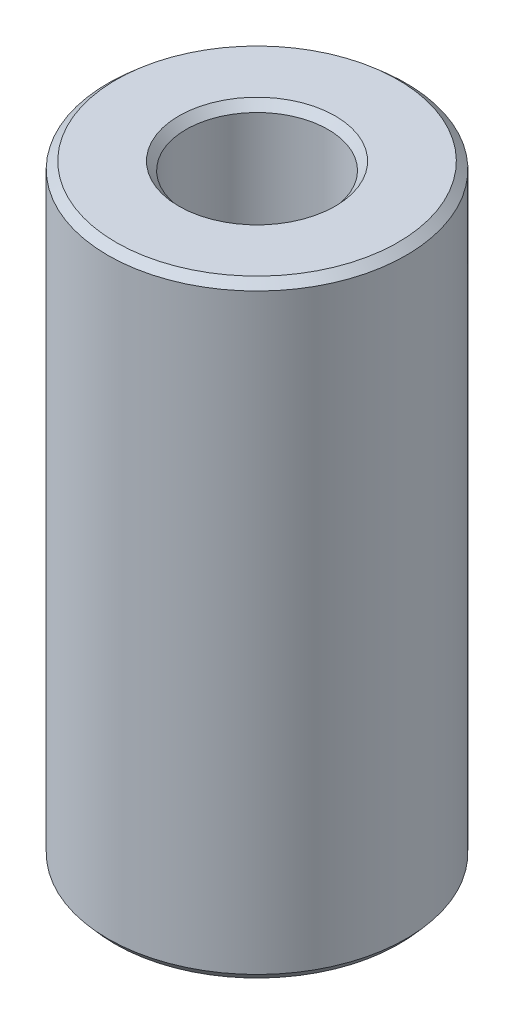
ISO-10303-21;
HEADER;
FILE_DESCRIPTION(('STEP AP214'),'2;1');
FILE_NAME('part.step','',(''),(''),'','','');
FILE_SCHEMA(('AUTOMOTIVE_DESIGN { 1 0 10303 214 1 1 1 1 }'));
ENDSEC;
DATA;
#1=APPLICATION_CONTEXT('core data for automotive mechanical design processes');
#2=APPLICATION_PROTOCOL_DEFINITION('international standard','automotive_design',2000,#1);
#3=PRODUCT_CONTEXT('',#1,'mechanical');
#4=PRODUCT('Part','Part','',(#3));
#5=PRODUCT_RELATED_PRODUCT_CATEGORY('part','',(#4));
#6=PRODUCT_DEFINITION_FORMATION('','',#4);
#7=PRODUCT_DEFINITION_CONTEXT('part definition',#1,'design');
#8=PRODUCT_DEFINITION('design','',#6,#7);
#9=PRODUCT_DEFINITION_SHAPE('','',#8);
#10=(LENGTH_UNIT() NAMED_UNIT(*) SI_UNIT(.MILLI.,.METRE.));
#11=(NAMED_UNIT(*) PLANE_ANGLE_UNIT() SI_UNIT($,.RADIAN.));
#12=(NAMED_UNIT(*) SI_UNIT($,.STERADIAN.) SOLID_ANGLE_UNIT());
#13=UNCERTAINTY_MEASURE_WITH_UNIT(LENGTH_MEASURE(1.E-05),#10,'distance_accuracy_value','');
#14=(GEOMETRIC_REPRESENTATION_CONTEXT(3) GLOBAL_UNCERTAINTY_ASSIGNED_CONTEXT((#13)) GLOBAL_UNIT_ASSIGNED_CONTEXT((#10,
#11,#12)) REPRESENTATION_CONTEXT('',''));
#15=CARTESIAN_POINT('',(0.,0.,0.));
#16=DIRECTION('',(0.,0.,1.));
#17=DIRECTION('',(1.,0.,0.));
#18=AXIS2_PLACEMENT_3D('',#15,#16,#17);
#19=CARTESIAN_POINT('',(0.,20.3630808135255,0.));
#20=DIRECTION('',(0.,-1.,0.));
#21=DIRECTION('',(0.,0.,-1.));
#22=AXIS2_PLACEMENT_3D('',#19,#20,#21);
#23=CYLINDRICAL_SURFACE('',#22,5.);
#24=CARTESIAN_POINT('',(0.,0.273540250249591,0.));
#25=DIRECTION('',(0.,1.,0.));
#26=DIRECTION('',(0.,0.,1.));
#27=AXIS2_PLACEMENT_3D('',#24,#25,#26);
#28=CIRCLE('',#27,5.);
#29=CARTESIAN_POINT('',(0.,0.273540250249591,5.));
#30=VERTEX_POINT('',#29);
#31=EDGE_CURVE('E10',#30,#30,#28,.T.);
#32=ORIENTED_EDGE('',*,*,#31,.T.);
#33=EDGE_LOOP('',(#32));
#34=FACE_BOUND('',#33,.T.);
#35=CARTESIAN_POINT('',(0.,20.1231590128088,0.));
#36=DIRECTION('',(0.,1.,0.));
#37=DIRECTION('',(0.,0.,1.));
#38=AXIS2_PLACEMENT_3D('',#35,#36,#37);
#39=CIRCLE('',#38,5.);
#40=CARTESIAN_POINT('',(0.,20.1231590128088,5.));
#41=VERTEX_POINT('',#40);
#42=EDGE_CURVE('E50',#41,#41,#39,.F.);
#43=ORIENTED_EDGE('',*,*,#42,.T.);
#44=EDGE_LOOP('',(#43));
#45=FACE_BOUND('',#44,.T.);
#46=ADVANCED_FACE('F39',(#34,#45),#23,.T.);
#47=CARTESIAN_POINT('',(0.,20.3630808135255,0.));
#48=DIRECTION('',(0.,1.,0.));
#49=DIRECTION('',(0.,0.,1.));
#50=AXIS2_PLACEMENT_3D('',#47,#48,#49);
#51=PLANE('',#50);
#52=CARTESIAN_POINT('',(0.,20.3630808135255,0.));
#53=DIRECTION('',(0.,1.,0.));
#54=DIRECTION('',(0.,0.,1.));
#55=AXIS2_PLACEMENT_3D('',#52,#53,#54);
#56=CIRCLE('',#55,2.62326293753086);
#57=CARTESIAN_POINT('',(0.,20.3630808135255,2.62326293753086));
#58=VERTEX_POINT('',#57);
#59=EDGE_CURVE('E58',#58,#58,#56,.F.);
#60=ORIENTED_EDGE('',*,*,#59,.T.);
#61=EDGE_LOOP('',(#60));
#62=FACE_BOUND('',#61,.T.);
#63=CARTESIAN_POINT('',(0.,20.3630808135255,0.));
#64=DIRECTION('',(0.,1.,0.));
#65=DIRECTION('',(0.,0.,1.));
#66=AXIS2_PLACEMENT_3D('',#63,#64,#65);
#67=CIRCLE('',#66,4.72645974975041);
#68=CARTESIAN_POINT('',(0.,20.3630808135255,4.72645974975041));
#69=VERTEX_POINT('',#68);
#70=EDGE_CURVE('E61',#69,#69,#67,.T.);
#71=ORIENTED_EDGE('',*,*,#70,.T.);
#72=EDGE_LOOP('',(#71));
#73=FACE_BOUND('',#72,.T.);
#74=ADVANCED_FACE('F88',(#62,#73),#51,.T.);
#75=CARTESIAN_POINT('',(0.,0.,0.));
#76=DIRECTION('',(0.,1.,0.));
#77=DIRECTION('',(0.,0.,1.));
#78=AXIS2_PLACEMENT_3D('',#75,#76,#77);
#79=PLANE('',#78);
#80=CARTESIAN_POINT('',(0.,0.,0.));
#81=DIRECTION('',(0.,1.,0.));
#82=DIRECTION('',(0.,0.,1.));
#83=AXIS2_PLACEMENT_3D('',#80,#81,#82);
#84=CIRCLE('',#83,2.65688138706379);
#85=CARTESIAN_POINT('',(0.,0.,2.65688138706379));
#86=VERTEX_POINT('',#85);
#87=EDGE_CURVE('E51',#86,#86,#84,.T.);
#88=ORIENTED_EDGE('',*,*,#87,.T.);
#89=EDGE_LOOP('',(#88));
#90=FACE_BOUND('',#89,.T.);
#91=CARTESIAN_POINT('',(0.,0.,0.));
#92=DIRECTION('',(0.,1.,0.));
#93=DIRECTION('',(0.,0.,1.));
#94=AXIS2_PLACEMENT_3D('',#91,#92,#93);
#95=CIRCLE('',#94,4.76007819928334);
#96=CARTESIAN_POINT('',(0.,0.,4.76007819928334));
#97=VERTEX_POINT('',#96);
#98=EDGE_CURVE('E54',#97,#97,#95,.F.);
#99=ORIENTED_EDGE('',*,*,#98,.T.);
#100=EDGE_LOOP('',(#99));
#101=FACE_BOUND('',#100,.T.);
#102=ADVANCED_FACE('F83',(#90,#101),#79,.F.);
#103=CARTESIAN_POINT('',(0.,20.3630808135255,0.));
#104=DIRECTION('',(0.,-1.,0.));
#105=DIRECTION('',(0.,0.,-1.));
#106=AXIS2_PLACEMENT_3D('',#103,#104,#105);
#107=CYLINDRICAL_SURFACE('',#106,2.3833411368142);
#108=CARTESIAN_POINT('',(0.,20.0895405632759,0.));
#109=DIRECTION('',(0.,1.,0.));
#110=DIRECTION('',(0.,0.,1.));
#111=AXIS2_PLACEMENT_3D('',#108,#109,#110);
#112=CIRCLE('',#111,2.3833411368142);
#113=CARTESIAN_POINT('',(0.,20.0895405632759,2.3833411368142));
#114=VERTEX_POINT('',#113);
#115=EDGE_CURVE('E67',#114,#114,#112,.T.);
#116=ORIENTED_EDGE('',*,*,#115,.T.);
#117=EDGE_LOOP('',(#116));
#118=FACE_BOUND('',#117,.T.);
#119=CARTESIAN_POINT('',(0.,0.23992180071666,0.));
#120=DIRECTION('',(0.,1.,0.));
#121=DIRECTION('',(0.,0.,1.));
#122=AXIS2_PLACEMENT_3D('',#119,#120,#121);
#123=CIRCLE('',#122,2.3833411368142);
#124=CARTESIAN_POINT('',(0.,0.23992180071666,2.3833411368142));
#125=VERTEX_POINT('',#124);
#126=EDGE_CURVE('E69',#125,#125,#123,.F.);
#127=ORIENTED_EDGE('',*,*,#126,.T.);
#128=EDGE_LOOP('',(#127));
#129=FACE_BOUND('',#128,.T.);
#130=ADVANCED_FACE('F71',(#118,#129),#107,.F.);
#131=CARTESIAN_POINT('',(0.,20.0895405632759,0.));
#132=DIRECTION('',(0.,1.,0.));
#133=DIRECTION('',(0.,0.,1.));
#134=AXIS2_PLACEMENT_3D('',#131,#132,#133);
#135=CONICAL_SURFACE('',#134,2.3833411368142,0.720017414167279);
#136=ORIENTED_EDGE('',*,*,#59,.F.);
#137=EDGE_LOOP('',(#136));
#138=FACE_BOUND('',#137,.T.);
#139=ORIENTED_EDGE('',*,*,#115,.F.);
#140=EDGE_LOOP('',(#139));
#141=FACE_BOUND('',#140,.T.);
#142=ADVANCED_FACE('F77',(#138,#141),#135,.F.);
#143=CARTESIAN_POINT('',(0.,0.,0.));
#144=DIRECTION('',(0.,-1.,0.));
#145=DIRECTION('',(0.,0.,-1.));
#146=AXIS2_PLACEMENT_3D('',#143,#144,#145);
#147=CONICAL_SURFACE('',#146,2.65688138706379,0.850778912627618);
#148=ORIENTED_EDGE('',*,*,#126,.F.);
#149=EDGE_LOOP('',(#148));
#150=FACE_BOUND('',#149,.T.);
#151=ORIENTED_EDGE('',*,*,#87,.F.);
#152=EDGE_LOOP('',(#151));
#153=FACE_BOUND('',#152,.T.);
#154=ADVANCED_FACE('F73',(#150,#153),#147,.F.);
#155=CARTESIAN_POINT('',(0.,0.273540250249591,0.));
#156=DIRECTION('',(0.,1.,0.));
#157=DIRECTION('',(0.,0.,1.));
#158=AXIS2_PLACEMENT_3D('',#155,#156,#157);
#159=CONICAL_SURFACE('',#158,5.,0.720017414167278);
#160=ORIENTED_EDGE('',*,*,#98,.F.);
#161=EDGE_LOOP('',(#160));
#162=FACE_BOUND('',#161,.T.);
#163=ORIENTED_EDGE('',*,*,#31,.F.);
#164=EDGE_LOOP('',(#163));
#165=FACE_BOUND('',#164,.T.);
#166=ADVANCED_FACE('F76',(#162,#165),#159,.T.);
#167=CARTESIAN_POINT('',(0.,20.3630808135255,0.));
#168=DIRECTION('',(0.,-1.,0.));
#169=DIRECTION('',(0.,0.,-1.));
#170=AXIS2_PLACEMENT_3D('',#167,#168,#169);
#171=CONICAL_SURFACE('',#170,4.72645974975041,0.850778912627618);
#172=ORIENTED_EDGE('',*,*,#42,.F.);
#173=EDGE_LOOP('',(#172));
#174=FACE_BOUND('',#173,.T.);
#175=ORIENTED_EDGE('',*,*,#70,.F.);
#176=EDGE_LOOP('',(#175));
#177=FACE_BOUND('',#176,.T.);
#178=ADVANCED_FACE('F45',(#174,#177),#171,.T.);
#179=CLOSED_SHELL('',(#46,#74,#102,#130,#142,#154,#166,#178));
#180=MANIFOLD_SOLID_BREP('B2',#179);
#181=ADVANCED_BREP_SHAPE_REPRESENTATION('',(#18,#180),#14);
#182=SHAPE_DEFINITION_REPRESENTATION(#9,#181);
ENDSEC;
END-ISO-10303-21;
